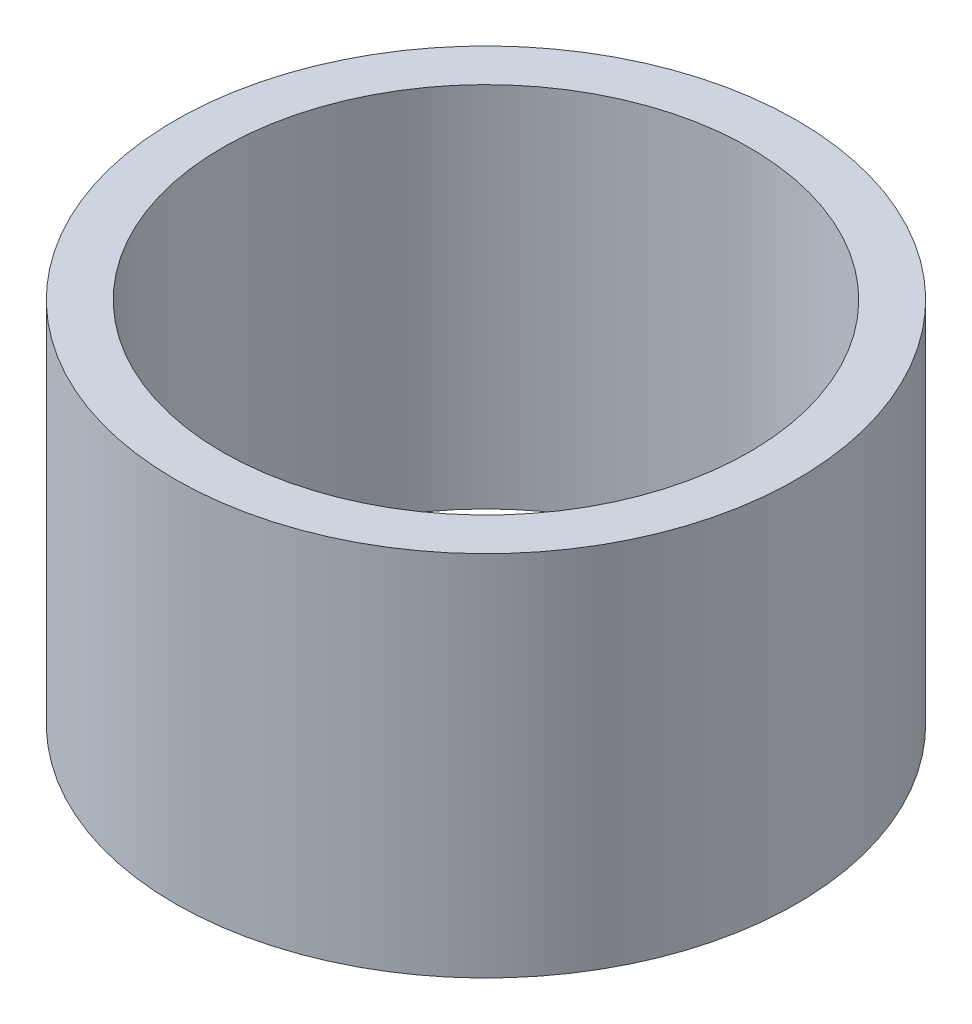
ISO-10303-21;
HEADER;
FILE_DESCRIPTION(('STEP AP214'),'2;1');
FILE_NAME('part.step','',(''),(''),'','','');
FILE_SCHEMA(('AUTOMOTIVE_DESIGN { 1 0 10303 214 1 1 1 1 }'));
ENDSEC;
DATA;
#1=APPLICATION_CONTEXT('core data for automotive mechanical design processes');
#2=APPLICATION_PROTOCOL_DEFINITION('international standard','automotive_design',2000,#1);
#3=PRODUCT_CONTEXT('',#1,'mechanical');
#4=PRODUCT('Part','Part','',(#3));
#5=PRODUCT_RELATED_PRODUCT_CATEGORY('part','',(#4));
#6=PRODUCT_DEFINITION_FORMATION('','',#4);
#7=PRODUCT_DEFINITION_CONTEXT('part definition',#1,'design');
#8=PRODUCT_DEFINITION('design','',#6,#7);
#9=PRODUCT_DEFINITION_SHAPE('','',#8);
#10=(LENGTH_UNIT() NAMED_UNIT(*) SI_UNIT(.MILLI.,.METRE.));
#11=(NAMED_UNIT(*) PLANE_ANGLE_UNIT() SI_UNIT($,.RADIAN.));
#12=(NAMED_UNIT(*) SI_UNIT($,.STERADIAN.) SOLID_ANGLE_UNIT());
#13=UNCERTAINTY_MEASURE_WITH_UNIT(LENGTH_MEASURE(1.E-05),#10,'distance_accuracy_value','');
#14=(GEOMETRIC_REPRESENTATION_CONTEXT(3) GLOBAL_UNCERTAINTY_ASSIGNED_CONTEXT((#13)) GLOBAL_UNIT_ASSIGNED_CONTEXT((#10,
#11,#12)) REPRESENTATION_CONTEXT('',''));
#15=CARTESIAN_POINT('',(0.,0.,0.));
#16=DIRECTION('',(0.,0.,1.));
#17=DIRECTION('',(1.,0.,0.));
#18=AXIS2_PLACEMENT_3D('',#15,#16,#17);
#19=CARTESIAN_POINT('',(0.,32.5045761192927,0.));
#20=DIRECTION('',(0.,-1.,0.));
#21=DIRECTION('',(0.,0.,-1.));
#22=AXIS2_PLACEMENT_3D('',#19,#20,#21);
#23=CYLINDRICAL_SURFACE('',#22,27.5);
#24=CARTESIAN_POINT('',(0.,32.5045761192927,0.));
#25=DIRECTION('',(0.,1.,0.));
#26=DIRECTION('',(0.,0.,1.));
#27=AXIS2_PLACEMENT_3D('',#24,#25,#26);
#28=CIRCLE('',#27,27.5);
#29=CARTESIAN_POINT('',(0.,32.5045761192927,27.5));
#30=VERTEX_POINT('',#29);
#31=EDGE_CURVE('E10',#30,#30,#28,.T.);
#32=ORIENTED_EDGE('',*,*,#31,.F.);
#33=EDGE_LOOP('',(#32));
#34=FACE_BOUND('',#33,.T.);
#35=CARTESIAN_POINT('',(0.,0.,0.));
#36=DIRECTION('',(0.,1.,0.));
#37=DIRECTION('',(0.,0.,1.));
#38=AXIS2_PLACEMENT_3D('',#35,#36,#37);
#39=CIRCLE('',#38,27.5);
#40=CARTESIAN_POINT('',(0.,0.,27.5));
#41=VERTEX_POINT('',#40);
#42=EDGE_CURVE('E37',#41,#41,#39,.T.);
#43=ORIENTED_EDGE('',*,*,#42,.T.);
#44=EDGE_LOOP('',(#43));
#45=FACE_BOUND('',#44,.T.);
#46=ADVANCED_FACE('F40',(#34,#45),#23,.T.);
#47=CARTESIAN_POINT('',(0.,32.5045761192927,0.));
#48=DIRECTION('',(0.,1.,0.));
#49=DIRECTION('',(0.,0.,1.));
#50=AXIS2_PLACEMENT_3D('',#47,#48,#49);
#51=PLANE('',#50);
#52=CARTESIAN_POINT('',(0.,32.5045761192927,0.));
#53=DIRECTION('',(0.,1.,0.));
#54=DIRECTION('',(0.,0.,1.));
#55=AXIS2_PLACEMENT_3D('',#52,#53,#54);
#56=CIRCLE('',#55,23.3138309729272);
#57=CARTESIAN_POINT('',(0.,32.5045761192927,23.3138309729272));
#58=VERTEX_POINT('',#57);
#59=EDGE_CURVE('E50',#58,#58,#56,.T.);
#60=ORIENTED_EDGE('',*,*,#59,.F.);
#61=EDGE_LOOP('',(#60));
#62=FACE_BOUND('',#61,.T.);
#63=ORIENTED_EDGE('',*,*,#31,.T.);
#64=EDGE_LOOP('',(#63));
#65=FACE_BOUND('',#64,.T.);
#66=ADVANCED_FACE('F59',(#62,#65),#51,.T.);
#67=CARTESIAN_POINT('',(0.,0.,0.));
#68=DIRECTION('',(0.,1.,0.));
#69=DIRECTION('',(0.,0.,1.));
#70=AXIS2_PLACEMENT_3D('',#67,#68,#69);
#71=PLANE('',#70);
#72=CARTESIAN_POINT('',(0.,0.,0.));
#73=DIRECTION('',(0.,1.,0.));
#74=DIRECTION('',(0.,0.,1.));
#75=AXIS2_PLACEMENT_3D('',#72,#73,#74);
#76=CIRCLE('',#75,23.3138309729272);
#77=CARTESIAN_POINT('',(0.,0.,23.3138309729272));
#78=VERTEX_POINT('',#77);
#79=EDGE_CURVE('E47',#78,#78,#76,.T.);
#80=ORIENTED_EDGE('',*,*,#79,.T.);
#81=EDGE_LOOP('',(#80));
#82=FACE_BOUND('',#81,.T.);
#83=ORIENTED_EDGE('',*,*,#42,.F.);
#84=EDGE_LOOP('',(#83));
#85=FACE_BOUND('',#84,.T.);
#86=ADVANCED_FACE('F58',(#82,#85),#71,.F.);
#87=CARTESIAN_POINT('',(0.,32.5045761192927,0.));
#88=DIRECTION('',(0.,-1.,0.));
#89=DIRECTION('',(0.,0.,-1.));
#90=AXIS2_PLACEMENT_3D('',#87,#88,#89);
#91=CYLINDRICAL_SURFACE('',#90,23.3138309729272);
#92=ORIENTED_EDGE('',*,*,#59,.T.);
#93=EDGE_LOOP('',(#92));
#94=FACE_BOUND('',#93,.T.);
#95=ORIENTED_EDGE('',*,*,#79,.F.);
#96=EDGE_LOOP('',(#95));
#97=FACE_BOUND('',#96,.T.);
#98=ADVANCED_FACE('F54',(#94,#97),#91,.F.);
#99=CLOSED_SHELL('',(#46,#66,#86,#98));
#100=MANIFOLD_SOLID_BREP('B2',#99);
#101=ADVANCED_BREP_SHAPE_REPRESENTATION('',(#18,#100),#14);
#102=SHAPE_DEFINITION_REPRESENTATION(#9,#101);
ENDSEC;
END-ISO-10303-21;
